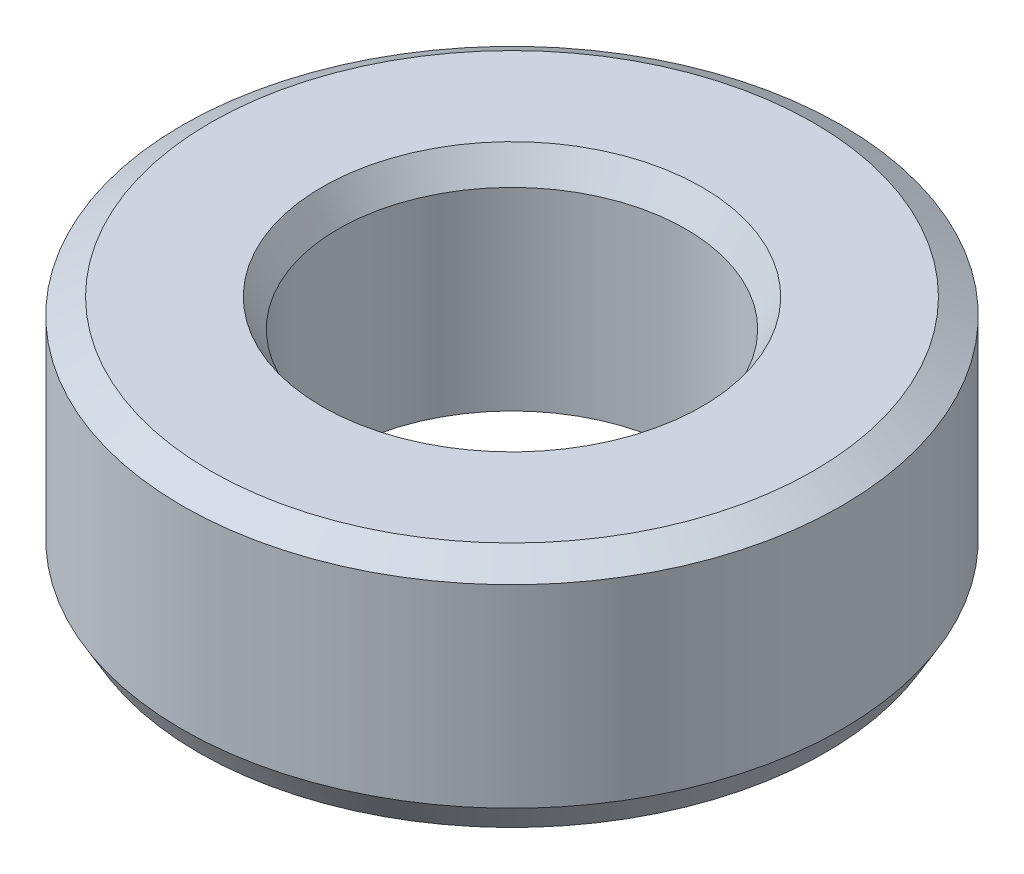
ISO-10303-21;
HEADER;
FILE_DESCRIPTION(('STEP AP214'),'2;1');
FILE_NAME('part.step','',(''),(''),'','','');
FILE_SCHEMA(('AUTOMOTIVE_DESIGN { 1 0 10303 214 1 1 1 1 }'));
ENDSEC;
DATA;
#1=APPLICATION_CONTEXT('core data for automotive mechanical design processes');
#2=APPLICATION_PROTOCOL_DEFINITION('international standard','automotive_design',2000,#1);
#3=PRODUCT_CONTEXT('',#1,'mechanical');
#4=PRODUCT('Part','Part','',(#3));
#5=PRODUCT_RELATED_PRODUCT_CATEGORY('part','',(#4));
#6=PRODUCT_DEFINITION_FORMATION('','',#4);
#7=PRODUCT_DEFINITION_CONTEXT('part definition',#1,'design');
#8=PRODUCT_DEFINITION('design','',#6,#7);
#9=PRODUCT_DEFINITION_SHAPE('','',#8);
#10=(LENGTH_UNIT() NAMED_UNIT(*) SI_UNIT(.MILLI.,.METRE.));
#11=(NAMED_UNIT(*) PLANE_ANGLE_UNIT() SI_UNIT($,.RADIAN.));
#12=(NAMED_UNIT(*) SI_UNIT($,.STERADIAN.) SOLID_ANGLE_UNIT());
#13=UNCERTAINTY_MEASURE_WITH_UNIT(LENGTH_MEASURE(1.E-05),#10,'distance_accuracy_value','');
#14=(GEOMETRIC_REPRESENTATION_CONTEXT(3) GLOBAL_UNCERTAINTY_ASSIGNED_CONTEXT((#13)) GLOBAL_UNIT_ASSIGNED_CONTEXT((#10,
#11,#12)) REPRESENTATION_CONTEXT('',''));
#15=CARTESIAN_POINT('',(0.,0.,0.));
#16=DIRECTION('',(0.,0.,1.));
#17=DIRECTION('',(1.,0.,0.));
#18=AXIS2_PLACEMENT_3D('',#15,#16,#17);
#19=CARTESIAN_POINT('',(0.,34.286370078384,0.));
#20=DIRECTION('',(0.,-1.,0.));
#21=DIRECTION('',(0.,0.,-1.));
#22=AXIS2_PLACEMENT_3D('',#19,#20,#21);
#23=CYLINDRICAL_SURFACE('',#22,47.5);
#24=CARTESIAN_POINT('',(0.,4.05347776435057,0.));
#25=DIRECTION('',(0.,1.,0.));
#26=DIRECTION('',(0.,0.,1.));
#27=AXIS2_PLACEMENT_3D('',#24,#25,#26);
#28=CIRCLE('',#27,47.5);
#29=CARTESIAN_POINT('',(0.,4.05347776435057,47.5));
#30=VERTEX_POINT('',#29);
#31=EDGE_CURVE('E10',#30,#30,#28,.T.);
#32=ORIENTED_EDGE('',*,*,#31,.T.);
#33=EDGE_LOOP('',(#32));
#34=FACE_BOUND('',#33,.T.);
#35=CARTESIAN_POINT('',(0.,31.946093599982,0.));
#36=DIRECTION('',(0.,1.,0.));
#37=DIRECTION('',(0.,0.,1.));
#38=AXIS2_PLACEMENT_3D('',#35,#36,#37);
#39=CIRCLE('',#38,47.5);
#40=CARTESIAN_POINT('',(0.,31.946093599982,47.5));
#41=VERTEX_POINT('',#40);
#42=EDGE_CURVE('E50',#41,#41,#39,.F.);
#43=ORIENTED_EDGE('',*,*,#42,.T.);
#44=EDGE_LOOP('',(#43));
#45=FACE_BOUND('',#44,.T.);
#46=ADVANCED_FACE('F39',(#34,#45),#23,.T.);
#47=CARTESIAN_POINT('',(0.,34.286370078384,0.));
#48=DIRECTION('',(0.,1.,0.));
#49=DIRECTION('',(0.,0.,1.));
#50=AXIS2_PLACEMENT_3D('',#47,#48,#49);
#51=PLANE('',#50);
#52=CARTESIAN_POINT('',(0.,34.286370078384,0.));
#53=DIRECTION('',(0.,1.,0.));
#54=DIRECTION('',(0.,0.,1.));
#55=AXIS2_PLACEMENT_3D('',#52,#53,#54);
#56=CIRCLE('',#55,27.3754686911134);
#57=CARTESIAN_POINT('',(0.,34.286370078384,27.3754686911134));
#58=VERTEX_POINT('',#57);
#59=EDGE_CURVE('E58',#58,#58,#56,.F.);
#60=ORIENTED_EDGE('',*,*,#59,.T.);
#61=EDGE_LOOP('',(#60));
#62=FACE_BOUND('',#61,.T.);
#63=CARTESIAN_POINT('',(0.,34.286370078384,0.));
#64=DIRECTION('',(0.,1.,0.));
#65=DIRECTION('',(0.,0.,1.));
#66=AXIS2_PLACEMENT_3D('',#63,#64,#65);
#67=CIRCLE('',#66,43.4465222356494);
#68=CARTESIAN_POINT('',(0.,34.286370078384,43.4465222356494));
#69=VERTEX_POINT('',#68);
#70=EDGE_CURVE('E61',#69,#69,#67,.T.);
#71=ORIENTED_EDGE('',*,*,#70,.T.);
#72=EDGE_LOOP('',(#71));
#73=FACE_BOUND('',#72,.T.);
#74=ADVANCED_FACE('F88',(#62,#73),#51,.T.);
#75=CARTESIAN_POINT('',(0.,0.,0.));
#76=DIRECTION('',(0.,1.,0.));
#77=DIRECTION('',(0.,0.,1.));
#78=AXIS2_PLACEMENT_3D('',#75,#76,#77);
#79=PLANE('',#78);
#80=CARTESIAN_POINT('',(0.,0.,0.));
#81=DIRECTION('',(0.,1.,0.));
#82=DIRECTION('',(0.,0.,1.));
#83=AXIS2_PLACEMENT_3D('',#80,#81,#82);
#84=CIRCLE('',#83,29.088669977062);
#85=CARTESIAN_POINT('',(0.,0.,29.088669977062));
#86=VERTEX_POINT('',#85);
#87=EDGE_CURVE('E51',#86,#86,#84,.T.);
#88=ORIENTED_EDGE('',*,*,#87,.T.);
#89=EDGE_LOOP('',(#88));
#90=FACE_BOUND('',#89,.T.);
#91=CARTESIAN_POINT('',(0.,0.,0.));
#92=DIRECTION('',(0.,1.,0.));
#93=DIRECTION('',(0.,0.,1.));
#94=AXIS2_PLACEMENT_3D('',#91,#92,#93);
#95=CIRCLE('',#94,45.159723521598);
#96=CARTESIAN_POINT('',(0.,0.,45.159723521598));
#97=VERTEX_POINT('',#96);
#98=EDGE_CURVE('E54',#97,#97,#95,.F.);
#99=ORIENTED_EDGE('',*,*,#98,.T.);
#100=EDGE_LOOP('',(#99));
#101=FACE_BOUND('',#100,.T.);
#102=ADVANCED_FACE('F83',(#90,#101),#79,.F.);
#103=CARTESIAN_POINT('',(0.,34.286370078384,0.));
#104=DIRECTION('',(0.,-1.,0.));
#105=DIRECTION('',(0.,0.,-1.));
#106=AXIS2_PLACEMENT_3D('',#103,#104,#105);
#107=CYLINDRICAL_SURFACE('',#106,25.0351922127114);
#108=CARTESIAN_POINT('',(0.,30.2328923140334,0.));
#109=DIRECTION('',(0.,1.,0.));
#110=DIRECTION('',(0.,0.,1.));
#111=AXIS2_PLACEMENT_3D('',#108,#109,#110);
#112=CIRCLE('',#111,25.0351922127114);
#113=CARTESIAN_POINT('',(0.,30.2328923140334,25.0351922127114));
#114=VERTEX_POINT('',#113);
#115=EDGE_CURVE('E67',#114,#114,#112,.T.);
#116=ORIENTED_EDGE('',*,*,#115,.T.);
#117=EDGE_LOOP('',(#116));
#118=FACE_BOUND('',#117,.T.);
#119=CARTESIAN_POINT('',(0.,2.340276478402,0.));
#120=DIRECTION('',(0.,1.,0.));
#121=DIRECTION('',(0.,0.,1.));
#122=AXIS2_PLACEMENT_3D('',#119,#120,#121);
#123=CIRCLE('',#122,25.0351922127114);
#124=CARTESIAN_POINT('',(0.,2.340276478402,25.0351922127114));
#125=VERTEX_POINT('',#124);
#126=EDGE_CURVE('E69',#125,#125,#123,.F.);
#127=ORIENTED_EDGE('',*,*,#126,.T.);
#128=EDGE_LOOP('',(#127));
#129=FACE_BOUND('',#128,.T.);
#130=ADVANCED_FACE('F71',(#118,#129),#107,.F.);
#131=CARTESIAN_POINT('',(0.,30.2328923140334,0.));
#132=DIRECTION('',(0.,1.,0.));
#133=DIRECTION('',(0.,0.,1.));
#134=AXIS2_PLACEMENT_3D('',#131,#132,#133);
#135=CONICAL_SURFACE('',#134,25.0351922127114,0.5235987755983);
#136=ORIENTED_EDGE('',*,*,#59,.F.);
#137=EDGE_LOOP('',(#136));
#138=FACE_BOUND('',#137,.T.);
#139=ORIENTED_EDGE('',*,*,#115,.F.);
#140=EDGE_LOOP('',(#139));
#141=FACE_BOUND('',#140,.T.);
#142=ADVANCED_FACE('F77',(#138,#141),#135,.F.);
#143=CARTESIAN_POINT('',(0.,0.,0.));
#144=DIRECTION('',(0.,-1.,0.));
#145=DIRECTION('',(0.,0.,-1.));
#146=AXIS2_PLACEMENT_3D('',#143,#144,#145);
#147=CONICAL_SURFACE('',#146,29.088669977062,1.04719755119659);
#148=ORIENTED_EDGE('',*,*,#126,.F.);
#149=EDGE_LOOP('',(#148));
#150=FACE_BOUND('',#149,.T.);
#151=ORIENTED_EDGE('',*,*,#87,.F.);
#152=EDGE_LOOP('',(#151));
#153=FACE_BOUND('',#152,.T.);
#154=ADVANCED_FACE('F73',(#150,#153),#147,.F.);
#155=CARTESIAN_POINT('',(0.,4.05347776435057,0.));
#156=DIRECTION('',(0.,1.,0.));
#157=DIRECTION('',(0.,0.,1.));
#158=AXIS2_PLACEMENT_3D('',#155,#156,#157);
#159=CONICAL_SURFACE('',#158,47.5,0.523598775598302);
#160=ORIENTED_EDGE('',*,*,#98,.F.);
#161=EDGE_LOOP('',(#160));
#162=FACE_BOUND('',#161,.T.);
#163=ORIENTED_EDGE('',*,*,#31,.F.);
#164=EDGE_LOOP('',(#163));
#165=FACE_BOUND('',#164,.T.);
#166=ADVANCED_FACE('F76',(#162,#165),#159,.T.);
#167=CARTESIAN_POINT('',(0.,34.286370078384,0.));
#168=DIRECTION('',(0.,-1.,0.));
#169=DIRECTION('',(0.,0.,-1.));
#170=AXIS2_PLACEMENT_3D('',#167,#168,#169);
#171=CONICAL_SURFACE('',#170,43.4465222356494,1.0471975511966);
#172=ORIENTED_EDGE('',*,*,#42,.F.);
#173=EDGE_LOOP('',(#172));
#174=FACE_BOUND('',#173,.T.);
#175=ORIENTED_EDGE('',*,*,#70,.F.);
#176=EDGE_LOOP('',(#175));
#177=FACE_BOUND('',#176,.T.);
#178=ADVANCED_FACE('F45',(#174,#177),#171,.T.);
#179=CLOSED_SHELL('',(#46,#74,#102,#130,#142,#154,#166,#178));
#180=MANIFOLD_SOLID_BREP('B2',#179);
#181=ADVANCED_BREP_SHAPE_REPRESENTATION('',(#18,#180),#14);
#182=SHAPE_DEFINITION_REPRESENTATION(#9,#181);
ENDSEC;
END-ISO-10303-21;
